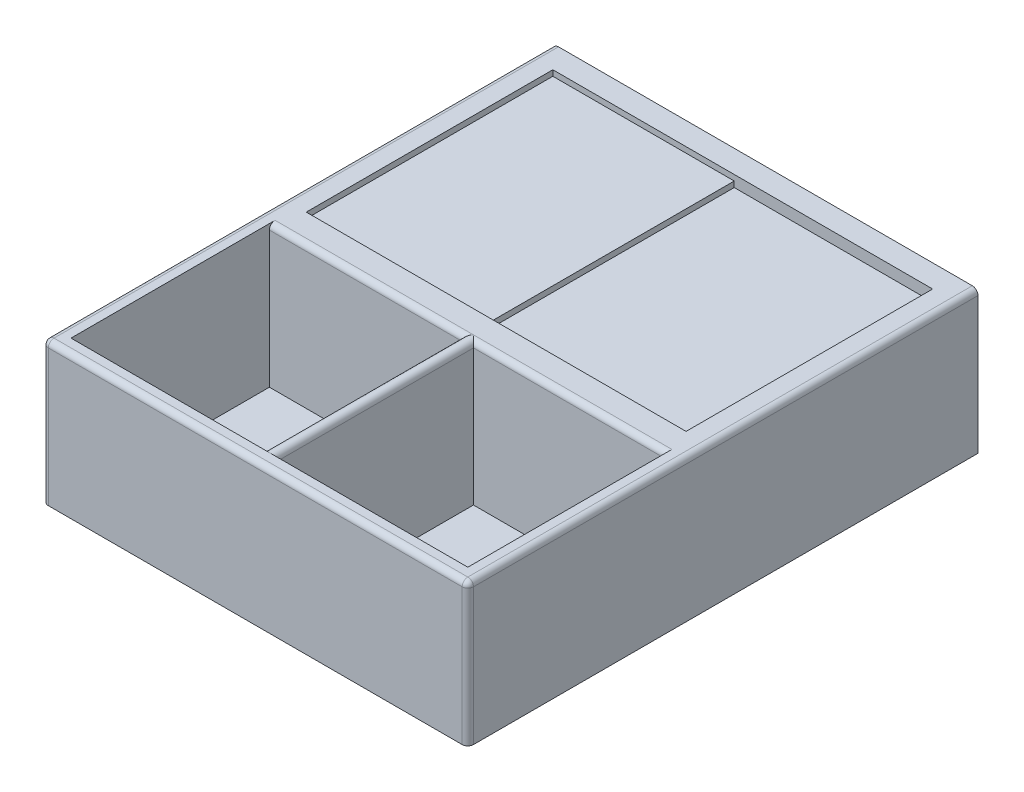
ISO-10303-21;
HEADER;
FILE_DESCRIPTION(('STEP AP214'),'2;1');
FILE_NAME('part.step','',(''),(''),'','','');
FILE_SCHEMA(('AUTOMOTIVE_DESIGN { 1 0 10303 214 1 1 1 1 }'));
ENDSEC;
DATA;
#1=APPLICATION_CONTEXT('core data for automotive mechanical design processes');
#2=APPLICATION_PROTOCOL_DEFINITION('international standard','automotive_design',2000,#1);
#3=PRODUCT_CONTEXT('',#1,'mechanical');
#4=PRODUCT('Part','Part','',(#3));
#5=PRODUCT_RELATED_PRODUCT_CATEGORY('part','',(#4));
#6=PRODUCT_DEFINITION_FORMATION('','',#4);
#7=PRODUCT_DEFINITION_CONTEXT('part definition',#1,'design');
#8=PRODUCT_DEFINITION('design','',#6,#7);
#9=PRODUCT_DEFINITION_SHAPE('','',#8);
#10=(LENGTH_UNIT() NAMED_UNIT(*) SI_UNIT(.MILLI.,.METRE.));
#11=(NAMED_UNIT(*) PLANE_ANGLE_UNIT() SI_UNIT($,.RADIAN.));
#12=(NAMED_UNIT(*) SI_UNIT($,.STERADIAN.) SOLID_ANGLE_UNIT());
#13=UNCERTAINTY_MEASURE_WITH_UNIT(LENGTH_MEASURE(1.E-05),#10,'distance_accuracy_value','');
#14=(GEOMETRIC_REPRESENTATION_CONTEXT(3) GLOBAL_UNCERTAINTY_ASSIGNED_CONTEXT((#13)) GLOBAL_UNIT_ASSIGNED_CONTEXT((#10,
#11,#12)) REPRESENTATION_CONTEXT('',''));
#15=CARTESIAN_POINT('',(0.,0.,0.));
#16=DIRECTION('',(0.,0.,1.));
#17=DIRECTION('',(1.,0.,0.));
#18=AXIS2_PLACEMENT_3D('',#15,#16,#17);
#19=CARTESIAN_POINT('',(-29.9999999999998,-1040.,1050.));
#20=DIRECTION('',(1.,0.,0.));
#21=DIRECTION('',(0.,0.,-1.));
#22=AXIS2_PLACEMENT_3D('',#19,#20,#21);
#23=PLANE('',#22);
#24=DIRECTION('',(0.,0.,-1.));
#25=VECTOR('',#24,1.);
#26=CARTESIAN_POINT('',(-29.9999999999998,-1020.,615.));
#27=LINE('',#26,#25);
#28=CARTESIAN_POINT('',(-29.9999999999998,-1020.,1050.));
#29=VERTEX_POINT('',#28);
#30=CARTESIAN_POINT('',(-29.9999999999998,-1020.,180.));
#31=VERTEX_POINT('',#30);
#32=EDGE_CURVE('E10',#29,#31,#27,.T.);
#33=ORIENTED_EDGE('',*,*,#32,.F.);
#34=DIRECTION('',(0.,1.,0.));
#35=VECTOR('',#34,1.);
#36=CARTESIAN_POINT('',(-29.9999999999998,-1030.,1050.));
#37=LINE('',#36,#35);
#38=CARTESIAN_POINT('',(-29.9999999999998,-1040.,1050.));
#39=VERTEX_POINT('',#38);
#40=EDGE_CURVE('E27',#39,#29,#37,.T.);
#41=ORIENTED_EDGE('',*,*,#40,.F.);
#42=DIRECTION('',(0.,0.,-1.));
#43=VECTOR('',#42,1.);
#44=CARTESIAN_POINT('',(-29.9999999999998,-1040.,615.));
#45=LINE('',#44,#43);
#46=CARTESIAN_POINT('',(-29.9999999999998,-1040.,180.));
#47=VERTEX_POINT('',#46);
#48=EDGE_CURVE('E390',#39,#47,#45,.T.);
#49=ORIENTED_EDGE('',*,*,#48,.T.);
#50=DIRECTION('',(0.,1.,0.));
#51=VECTOR('',#50,1.);
#52=CARTESIAN_POINT('',(-29.9999999999998,-1030.,180.));
#53=LINE('',#52,#51);
#54=EDGE_CURVE('E36',#47,#31,#53,.T.);
#55=ORIENTED_EDGE('',*,*,#54,.T.);
#56=EDGE_LOOP('',(#33,#41,#49,#55));
#57=FACE_BOUND('',#56,.T.);
#58=ADVANCED_FACE('F16',(#57),#23,.T.);
#59=CARTESIAN_POINT('',(0.,-1020.,0.));
#60=DIRECTION('',(0.,1.,0.));
#61=DIRECTION('',(0.,0.,1.));
#62=AXIS2_PLACEMENT_3D('',#59,#60,#61);
#63=PLANE('',#62);
#64=DIRECTION('',(1.,0.,0.));
#65=VECTOR('',#64,1.);
#66=CARTESIAN_POINT('',(-350.,-1020.,1050.));
#67=LINE('',#66,#65);
#68=CARTESIAN_POINT('',(-670.,-1020.,1050.));
#69=VERTEX_POINT('',#68);
#70=EDGE_CURVE('E453',#69,#29,#67,.T.);
#71=ORIENTED_EDGE('',*,*,#70,.T.);
#72=ORIENTED_EDGE('',*,*,#32,.T.);
#73=DIRECTION('',(-1.,0.,0.));
#74=VECTOR('',#73,1.);
#75=CARTESIAN_POINT('',(-350.,-1020.,180.));
#76=LINE('',#75,#74);
#77=CARTESIAN_POINT('',(-670.,-1020.,180.));
#78=VERTEX_POINT('',#77);
#79=EDGE_CURVE('E431',#31,#78,#76,.T.);
#80=ORIENTED_EDGE('',*,*,#79,.T.);
#81=DIRECTION('',(0.,0.,1.));
#82=VECTOR('',#81,1.);
#83=CARTESIAN_POINT('',(-670.,-1020.,615.));
#84=LINE('',#83,#82);
#85=EDGE_CURVE('E447',#78,#69,#84,.T.);
#86=ORIENTED_EDGE('',*,*,#85,.T.);
#87=EDGE_LOOP('',(#71,#72,#80,#86));
#88=FACE_BOUND('',#87,.T.);
#89=ADVANCED_FACE('F490',(#88),#63,.T.);
#90=CARTESIAN_POINT('',(-670.,-1000.,180.));
#91=DIRECTION('',(1.,0.,0.));
#92=DIRECTION('',(0.,0.,-1.));
#93=AXIS2_PLACEMENT_3D('',#90,#91,#92);
#94=PLANE('',#93);
#95=ORIENTED_EDGE('',*,*,#85,.F.);
#96=DIRECTION('',(0.,-1.,0.));
#97=VECTOR('',#96,1.);
#98=CARTESIAN_POINT('',(-670.,-1010.,180.));
#99=LINE('',#98,#97);
#100=CARTESIAN_POINT('',(-670.,-1000.,180.));
#101=VERTEX_POINT('',#100);
#102=EDGE_CURVE('E440',#101,#78,#99,.T.);
#103=ORIENTED_EDGE('',*,*,#102,.F.);
#104=DIRECTION('',(0.,0.,1.));
#105=VECTOR('',#104,1.);
#106=CARTESIAN_POINT('',(-670.,-1000.,615.000000000001));
#107=LINE('',#106,#105);
#108=CARTESIAN_POINT('',(-670.,-1000.,1050.));
#109=VERTEX_POINT('',#108);
#110=EDGE_CURVE('E208',#101,#109,#107,.T.);
#111=ORIENTED_EDGE('',*,*,#110,.T.);
#112=DIRECTION('',(0.,-1.,0.));
#113=VECTOR('',#112,1.);
#114=CARTESIAN_POINT('',(-670.,-1010.,1050.));
#115=LINE('',#114,#113);
#116=EDGE_CURVE('E420',#109,#69,#115,.T.);
#117=ORIENTED_EDGE('',*,*,#116,.T.);
#118=EDGE_LOOP('',(#95,#103,#111,#117));
#119=FACE_BOUND('',#118,.T.);
#120=ADVANCED_FACE('F488',(#119),#94,.T.);
#121=CARTESIAN_POINT('',(-670.,-1000.,180.));
#122=DIRECTION('',(0.,0.,-1.));
#123=DIRECTION('',(-1.,0.,0.));
#124=AXIS2_PLACEMENT_3D('',#121,#122,#123);
#125=PLANE('',#124);
#126=ORIENTED_EDGE('',*,*,#102,.T.);
#127=ORIENTED_EDGE('',*,*,#79,.F.);
#128=ORIENTED_EDGE('',*,*,#54,.F.);
#129=DIRECTION('',(-1.,0.,0.));
#130=VECTOR('',#129,1.);
#131=CARTESIAN_POINT('',(320.,-1040.,180.));
#132=LINE('',#131,#130);
#133=CARTESIAN_POINT('',(670.,-1040.,180.));
#134=VERTEX_POINT('',#133);
#135=EDGE_CURVE('E432',#134,#47,#132,.T.);
#136=ORIENTED_EDGE('',*,*,#135,.F.);
#137=DIRECTION('',(0.,-1.,0.));
#138=VECTOR('',#137,1.);
#139=CARTESIAN_POINT('',(670.,-1020.,180.));
#140=LINE('',#139,#138);
#141=CARTESIAN_POINT('',(670.,-1000.,180.));
#142=VERTEX_POINT('',#141);
#143=EDGE_CURVE('E436',#142,#134,#140,.T.);
#144=ORIENTED_EDGE('',*,*,#143,.F.);
#145=DIRECTION('',(-1.,0.,0.));
#146=VECTOR('',#145,1.);
#147=CARTESIAN_POINT('',(2.27373675443232E-13,-1000.,180.));
#148=LINE('',#147,#146);
#149=EDGE_CURVE('E427',#142,#101,#148,.T.);
#150=ORIENTED_EDGE('',*,*,#149,.T.);
#151=EDGE_LOOP('',(#126,#127,#128,#136,#144,#150));
#152=FACE_BOUND('',#151,.T.);
#153=ADVANCED_FACE('F475',(#152),#125,.F.);
#154=CARTESIAN_POINT('',(670.,-1000.,1050.));
#155=DIRECTION('',(-1.,0.,0.));
#156=DIRECTION('',(0.,0.,1.));
#157=AXIS2_PLACEMENT_3D('',#154,#155,#156);
#158=PLANE('',#157);
#159=DIRECTION('',(0.,0.,-1.));
#160=VECTOR('',#159,1.);
#161=CARTESIAN_POINT('',(670.,-1040.,615.));
#162=LINE('',#161,#160);
#163=CARTESIAN_POINT('',(670.,-1040.,1050.));
#164=VERTEX_POINT('',#163);
#165=EDGE_CURVE('E423',#164,#134,#162,.T.);
#166=ORIENTED_EDGE('',*,*,#165,.F.);
#167=DIRECTION('',(0.,-1.,0.));
#168=VECTOR('',#167,1.);
#169=CARTESIAN_POINT('',(670.,-1020.,1050.));
#170=LINE('',#169,#168);
#171=CARTESIAN_POINT('',(670.,-1000.,1050.));
#172=VERTEX_POINT('',#171);
#173=EDGE_CURVE('E419',#172,#164,#170,.T.);
#174=ORIENTED_EDGE('',*,*,#173,.F.);
#175=DIRECTION('',(0.,0.,-1.));
#176=VECTOR('',#175,1.);
#177=CARTESIAN_POINT('',(670.,-1000.,615.));
#178=LINE('',#177,#176);
#179=EDGE_CURVE('E414',#172,#142,#178,.T.);
#180=ORIENTED_EDGE('',*,*,#179,.T.);
#181=ORIENTED_EDGE('',*,*,#143,.T.);
#182=EDGE_LOOP('',(#166,#174,#180,#181));
#183=FACE_BOUND('',#182,.T.);
#184=ADVANCED_FACE('F481',(#183),#158,.T.);
#185=CARTESIAN_POINT('',(670.,-1000.,1050.));
#186=DIRECTION('',(0.,0.,1.));
#187=DIRECTION('',(1.,0.,0.));
#188=AXIS2_PLACEMENT_3D('',#185,#186,#187);
#189=PLANE('',#188);
#190=DIRECTION('',(1.,0.,0.));
#191=VECTOR('',#190,1.);
#192=CARTESIAN_POINT('',(320.,-1040.,1050.));
#193=LINE('',#192,#191);
#194=EDGE_CURVE('E415',#39,#164,#193,.T.);
#195=ORIENTED_EDGE('',*,*,#194,.F.);
#196=ORIENTED_EDGE('',*,*,#40,.T.);
#197=ORIENTED_EDGE('',*,*,#70,.F.);
#198=ORIENTED_EDGE('',*,*,#116,.F.);
#199=DIRECTION('',(1.,0.,0.));
#200=VECTOR('',#199,1.);
#201=CARTESIAN_POINT('',(3.41060513164848E-13,-1000.,1050.));
#202=LINE('',#201,#200);
#203=EDGE_CURVE('E359',#109,#172,#202,.T.);
#204=ORIENTED_EDGE('',*,*,#203,.T.);
#205=ORIENTED_EDGE('',*,*,#173,.T.);
#206=EDGE_LOOP('',(#195,#196,#197,#198,#204,#205));
#207=FACE_BOUND('',#206,.T.);
#208=ADVANCED_FACE('F492',(#207),#189,.F.);
#209=CARTESIAN_POINT('',(0.,-1040.,0.));
#210=DIRECTION('',(0.,1.,0.));
#211=DIRECTION('',(0.,0.,1.));
#212=AXIS2_PLACEMENT_3D('',#209,#210,#211);
#213=PLANE('',#212);
#214=ORIENTED_EDGE('',*,*,#48,.F.);
#215=ORIENTED_EDGE('',*,*,#194,.T.);
#216=ORIENTED_EDGE('',*,*,#165,.T.);
#217=ORIENTED_EDGE('',*,*,#135,.T.);
#218=EDGE_LOOP('',(#214,#215,#216,#217));
#219=FACE_BOUND('',#218,.T.);
#220=ADVANCED_FACE('F477',(#219),#213,.T.);
#221=CARTESIAN_POINT('',(0.,-1500.,0.));
#222=DIRECTION('',(0.,1.,0.));
#223=DIRECTION('',(0.,0.,1.));
#224=AXIS2_PLACEMENT_3D('',#221,#222,#223);
#225=PLANE('',#224);
#226=DIRECTION('',(1.,0.,0.));
#227=VECTOR('',#226,1.);
#228=CARTESIAN_POINT('',(360.,-1500.,1850.));
#229=LINE('',#228,#227);
#230=CARTESIAN_POINT('',(20.0000000000001,-1500.,1850.));
#231=VERTEX_POINT('',#230);
#232=CARTESIAN_POINT('',(700.,-1500.,1850.));
#233=VERTEX_POINT('',#232);
#234=EDGE_CURVE('E268',#231,#233,#229,.T.);
#235=ORIENTED_EDGE('',*,*,#234,.T.);
#236=DIRECTION('',(0.,0.,-1.));
#237=VECTOR('',#236,1.);
#238=CARTESIAN_POINT('',(700.,-1500.,1500.));
#239=LINE('',#238,#237);
#240=CARTESIAN_POINT('',(700.,-1500.,1150.));
#241=VERTEX_POINT('',#240);
#242=EDGE_CURVE('E279',#233,#241,#239,.T.);
#243=ORIENTED_EDGE('',*,*,#242,.T.);
#244=DIRECTION('',(-1.,0.,0.));
#245=VECTOR('',#244,1.);
#246=CARTESIAN_POINT('',(360.,-1500.,1150.));
#247=LINE('',#246,#245);
#248=CARTESIAN_POINT('',(20.,-1500.,1150.));
#249=VERTEX_POINT('',#248);
#250=EDGE_CURVE('E231',#241,#249,#247,.T.);
#251=ORIENTED_EDGE('',*,*,#250,.T.);
#252=DIRECTION('',(0.,0.,1.));
#253=VECTOR('',#252,1.);
#254=CARTESIAN_POINT('',(20.0000000000001,-1500.,1500.));
#255=LINE('',#254,#253);
#256=EDGE_CURVE('E227',#249,#231,#255,.T.);
#257=ORIENTED_EDGE('',*,*,#256,.T.);
#258=EDGE_LOOP('',(#235,#243,#251,#257));
#259=FACE_BOUND('',#258,.T.);
#260=ADVANCED_FACE('F500',(#259),#225,.T.);
#261=CARTESIAN_POINT('',(0.,-1500.,0.));
#262=DIRECTION('',(0.,1.,0.));
#263=DIRECTION('',(0.,0.,1.));
#264=AXIS2_PLACEMENT_3D('',#261,#262,#263);
#265=PLANE('',#264);
#266=DIRECTION('',(0.,0.,1.));
#267=VECTOR('',#266,1.);
#268=CARTESIAN_POINT('',(-700.,-1500.,1500.));
#269=LINE('',#268,#267);
#270=CARTESIAN_POINT('',(-700.,-1500.,1150.));
#271=VERTEX_POINT('',#270);
#272=CARTESIAN_POINT('',(-700.,-1500.,1850.));
#273=VERTEX_POINT('',#272);
#274=EDGE_CURVE('E240',#271,#273,#269,.T.);
#275=ORIENTED_EDGE('',*,*,#274,.T.);
#276=DIRECTION('',(1.,0.,0.));
#277=VECTOR('',#276,1.);
#278=CARTESIAN_POINT('',(-360.,-1500.,1850.));
#279=LINE('',#278,#277);
#280=CARTESIAN_POINT('',(-19.9999999999998,-1500.,1850.));
#281=VERTEX_POINT('',#280);
#282=EDGE_CURVE('E255',#273,#281,#279,.T.);
#283=ORIENTED_EDGE('',*,*,#282,.T.);
#284=DIRECTION('',(0.,0.,-1.));
#285=VECTOR('',#284,1.);
#286=CARTESIAN_POINT('',(-19.9999999999995,-1500.,1500.));
#287=LINE('',#286,#285);
#288=CARTESIAN_POINT('',(-19.9999999999995,-1500.,1150.));
#289=VERTEX_POINT('',#288);
#290=EDGE_CURVE('E263',#281,#289,#287,.T.);
#291=ORIENTED_EDGE('',*,*,#290,.T.);
#292=DIRECTION('',(-1.,0.,0.));
#293=VECTOR('',#292,1.);
#294=CARTESIAN_POINT('',(-360.,-1500.,1150.));
#295=LINE('',#294,#293);
#296=EDGE_CURVE('E241',#289,#271,#295,.T.);
#297=ORIENTED_EDGE('',*,*,#296,.T.);
#298=EDGE_LOOP('',(#275,#283,#291,#297));
#299=FACE_BOUND('',#298,.T.);
#300=ADVANCED_FACE('F544',(#299),#265,.T.);
#301=CARTESIAN_POINT('',(750.,0.,1900.));
#302=DIRECTION('',(-1.,0.,0.));
#303=DIRECTION('',(0.,0.,1.));
#304=AXIS2_PLACEMENT_3D('',#301,#302,#303);
#305=PLANE('',#304);
#306=DIRECTION('',(0.,-1.,0.));
#307=VECTOR('',#306,1.);
#308=CARTESIAN_POINT('',(750.,-1261.,100.));
#309=LINE('',#308,#307);
#310=CARTESIAN_POINT('',(750.,-1020.,100.));
#311=VERTEX_POINT('',#310);
#312=CARTESIAN_POINT('',(750.,-1502.,100.));
#313=VERTEX_POINT('',#312);
#314=EDGE_CURVE('E378',#311,#313,#309,.T.);
#315=ORIENTED_EDGE('',*,*,#314,.F.);
#316=DIRECTION('',(0.,0.,1.));
#317=VECTOR('',#316,1.);
#318=CARTESIAN_POINT('',(750.,-1020.,990.));
#319=LINE('',#318,#317);
#320=CARTESIAN_POINT('',(750.,-1020.,1880.));
#321=VERTEX_POINT('',#320);
#322=EDGE_CURVE('E371',#311,#321,#319,.T.);
#323=ORIENTED_EDGE('',*,*,#322,.T.);
#324=DIRECTION('',(0.,-1.,0.));
#325=VECTOR('',#324,1.);
#326=CARTESIAN_POINT('',(750.,-1261.,1880.));
#327=LINE('',#326,#325);
#328=CARTESIAN_POINT('',(750.,-1502.,1880.));
#329=VERTEX_POINT('',#328);
#330=EDGE_CURVE('E379',#321,#329,#327,.T.);
#331=ORIENTED_EDGE('',*,*,#330,.T.);
#332=DIRECTION('',(0.,0.,-1.));
#333=VECTOR('',#332,1.);
#334=CARTESIAN_POINT('',(750.,-1502.,990.));
#335=LINE('',#334,#333);
#336=EDGE_CURVE('E336',#329,#313,#335,.T.);
#337=ORIENTED_EDGE('',*,*,#336,.T.);
#338=EDGE_LOOP('',(#315,#323,#331,#337));
#339=FACE_BOUND('',#338,.T.);
#340=ADVANCED_FACE('F553',(#339),#305,.F.);
#341=CARTESIAN_POINT('',(730.,-1020.,1880.));
#342=DIRECTION('',(0.,0.,1.));
#343=DIRECTION('',(1.,0.,0.));
#344=AXIS2_PLACEMENT_3D('',#341,#342,#343);
#345=SPHERICAL_SURFACE('',#344,19.9999999999999);
#346=CARTESIAN_POINT('',(730.,-1020.,1880.));
#347=DIRECTION('',(0.,-1.,0.));
#348=DIRECTION('',(0.,0.,1.));
#349=AXIS2_PLACEMENT_3D('',#346,#347,#348);
#350=CIRCLE('',#349,19.9999999999999);
#351=CARTESIAN_POINT('',(730.,-1020.,1900.));
#352=VERTEX_POINT('',#351);
#353=EDGE_CURVE('E374',#321,#352,#350,.T.);
#354=ORIENTED_EDGE('',*,*,#353,.F.);
#355=CARTESIAN_POINT('',(730.,-1020.,1880.));
#356=DIRECTION('',(0.,0.,1.));
#357=DIRECTION('',(0.,1.,0.));
#358=AXIS2_PLACEMENT_3D('',#355,#356,#357);
#359=CIRCLE('',#358,19.9999999999999);
#360=CARTESIAN_POINT('',(730.,-1000.,1880.));
#361=VERTEX_POINT('',#360);
#362=EDGE_CURVE('E350',#321,#361,#359,.T.);
#363=ORIENTED_EDGE('',*,*,#362,.T.);
#364=CARTESIAN_POINT('',(730.,-1020.,1880.));
#365=DIRECTION('',(1.,0.,0.));
#366=DIRECTION('',(0.,0.,-1.));
#367=AXIS2_PLACEMENT_3D('',#364,#365,#366);
#368=CIRCLE('',#367,19.9999999999999);
#369=EDGE_CURVE('E308',#361,#352,#368,.T.);
#370=ORIENTED_EDGE('',*,*,#369,.T.);
#371=EDGE_LOOP('',(#354,#363,#370));
#372=FACE_BOUND('',#371,.T.);
#373=ADVANCED_FACE('F562',(#372),#345,.T.);
#374=CARTESIAN_POINT('',(730.,-1251.,1880.));
#375=DIRECTION('',(0.,-1.,0.));
#376=DIRECTION('',(0.,0.,-1.));
#377=AXIS2_PLACEMENT_3D('',#374,#375,#376);
#378=CYLINDRICAL_SURFACE('',#377,20.);
#379=CARTESIAN_POINT('',(730.,-1502.,1880.));
#380=DIRECTION('',(0.,1.,0.));
#381=DIRECTION('',(0.,0.,-1.));
#382=AXIS2_PLACEMENT_3D('',#379,#380,#381);
#383=CIRCLE('',#382,20.);
#384=CARTESIAN_POINT('',(730.,-1502.,1900.));
#385=VERTEX_POINT('',#384);
#386=EDGE_CURVE('E328',#385,#329,#383,.T.);
#387=ORIENTED_EDGE('',*,*,#386,.T.);
#388=ORIENTED_EDGE('',*,*,#330,.F.);
#389=ORIENTED_EDGE('',*,*,#353,.T.);
#390=DIRECTION('',(0.,-1.,0.));
#391=VECTOR('',#390,1.);
#392=CARTESIAN_POINT('',(730.,-1251.,1900.));
#393=LINE('',#392,#391);
#394=EDGE_CURVE('E307',#352,#385,#393,.T.);
#395=ORIENTED_EDGE('',*,*,#394,.T.);
#396=EDGE_LOOP('',(#387,#388,#389,#395));
#397=FACE_BOUND('',#396,.T.);
#398=ADVANCED_FACE('F571',(#397),#378,.T.);
#399=CARTESIAN_POINT('',(730.,-1020.,1000.));
#400=DIRECTION('',(0.,0.,1.));
#401=DIRECTION('',(1.,0.,0.));
#402=AXIS2_PLACEMENT_3D('',#399,#400,#401);
#403=CYLINDRICAL_SURFACE('',#402,20.);
#404=CARTESIAN_POINT('',(730.,-1020.,100.));
#405=DIRECTION('',(0.,0.,1.));
#406=DIRECTION('',(1.,0.,0.));
#407=AXIS2_PLACEMENT_3D('',#404,#405,#406);
#408=CIRCLE('',#407,20.);
#409=CARTESIAN_POINT('',(730.,-1000.,100.));
#410=VERTEX_POINT('',#409);
#411=EDGE_CURVE('E331',#311,#410,#408,.T.);
#412=ORIENTED_EDGE('',*,*,#411,.T.);
#413=DIRECTION('',(0.,0.,1.));
#414=VECTOR('',#413,1.);
#415=CARTESIAN_POINT('',(730.,-1000.,1000.));
#416=LINE('',#415,#414);
#417=EDGE_CURVE('E356',#410,#361,#416,.T.);
#418=ORIENTED_EDGE('',*,*,#417,.T.);
#419=ORIENTED_EDGE('',*,*,#362,.F.);
#420=ORIENTED_EDGE('',*,*,#322,.F.);
#421=EDGE_LOOP('',(#412,#418,#419,#420));
#422=FACE_BOUND('',#421,.T.);
#423=ADVANCED_FACE('F580',(#422),#403,.T.);
#424=CARTESIAN_POINT('',(-750.,0.,100.));
#425=DIRECTION('',(1.,0.,0.));
#426=DIRECTION('',(0.,0.,-1.));
#427=AXIS2_PLACEMENT_3D('',#424,#425,#426);
#428=PLANE('',#427);
#429=DIRECTION('',(0.,0.,1.));
#430=VECTOR('',#429,1.);
#431=CARTESIAN_POINT('',(-750.,-1502.,990.));
#432=LINE('',#431,#430);
#433=CARTESIAN_POINT('',(-750.,-1502.,100.));
#434=VERTEX_POINT('',#433);
#435=CARTESIAN_POINT('',(-750.,-1502.,1880.));
#436=VERTEX_POINT('',#435);
#437=EDGE_CURVE('E322',#434,#436,#432,.T.);
#438=ORIENTED_EDGE('',*,*,#437,.T.);
#439=DIRECTION('',(0.,-1.,0.));
#440=VECTOR('',#439,1.);
#441=CARTESIAN_POINT('',(-750.,-1261.,1880.));
#442=LINE('',#441,#440);
#443=CARTESIAN_POINT('',(-750.,-1020.,1880.));
#444=VERTEX_POINT('',#443);
#445=EDGE_CURVE('E341',#444,#436,#442,.T.);
#446=ORIENTED_EDGE('',*,*,#445,.F.);
#447=DIRECTION('',(0.,0.,1.));
#448=VECTOR('',#447,1.);
#449=CARTESIAN_POINT('',(-750.,-1020.,990.));
#450=LINE('',#449,#448);
#451=CARTESIAN_POINT('',(-750.,-1020.,100.));
#452=VERTEX_POINT('',#451);
#453=EDGE_CURVE('E346',#452,#444,#450,.T.);
#454=ORIENTED_EDGE('',*,*,#453,.F.);
#455=DIRECTION('',(0.,-1.,0.));
#456=VECTOR('',#455,1.);
#457=CARTESIAN_POINT('',(-750.,-1261.,100.));
#458=LINE('',#457,#456);
#459=EDGE_CURVE('E342',#452,#434,#458,.T.);
#460=ORIENTED_EDGE('',*,*,#459,.T.);
#461=EDGE_LOOP('',(#438,#446,#454,#460));
#462=FACE_BOUND('',#461,.T.);
#463=ADVANCED_FACE('F589',(#462),#428,.F.);
#464=CARTESIAN_POINT('',(-750.,0.,100.));
#465=DIRECTION('',(0.,0.,-1.));
#466=DIRECTION('',(-1.,0.,0.));
#467=AXIS2_PLACEMENT_3D('',#464,#465,#466);
#468=PLANE('',#467);
#469=CARTESIAN_POINT('',(-730.,-1020.,100.));
#470=DIRECTION('',(0.,0.,1.));
#471=DIRECTION('',(-1.,0.,0.));
#472=AXIS2_PLACEMENT_3D('',#469,#470,#471);
#473=CIRCLE('',#472,20.);
#474=CARTESIAN_POINT('',(-730.,-1000.,100.));
#475=VERTEX_POINT('',#474);
#476=EDGE_CURVE('E337',#475,#452,#473,.T.);
#477=ORIENTED_EDGE('',*,*,#476,.F.);
#478=DIRECTION('',(-1.,0.,0.));
#479=VECTOR('',#478,1.);
#480=CARTESIAN_POINT('',(1.13686837721616E-13,-1000.,100.));
#481=LINE('',#480,#479);
#482=EDGE_CURVE('E327',#410,#475,#481,.T.);
#483=ORIENTED_EDGE('',*,*,#482,.F.);
#484=ORIENTED_EDGE('',*,*,#411,.F.);
#485=ORIENTED_EDGE('',*,*,#314,.T.);
#486=DIRECTION('',(-1.,0.,0.));
#487=VECTOR('',#486,1.);
#488=CARTESIAN_POINT('',(1.13686837721616E-13,-1502.,100.));
#489=LINE('',#488,#487);
#490=EDGE_CURVE('E332',#313,#434,#489,.T.);
#491=ORIENTED_EDGE('',*,*,#490,.T.);
#492=ORIENTED_EDGE('',*,*,#459,.F.);
#493=EDGE_LOOP('',(#477,#483,#484,#485,#491,#492));
#494=FACE_BOUND('',#493,.T.);
#495=ADVANCED_FACE('F598',(#494),#468,.T.);
#496=CARTESIAN_POINT('',(0.,-1502.,0.));
#497=DIRECTION('',(0.,1.,0.));
#498=DIRECTION('',(0.,0.,1.));
#499=AXIS2_PLACEMENT_3D('',#496,#497,#498);
#500=PLANE('',#499);
#501=DIRECTION('',(1.,0.,0.));
#502=VECTOR('',#501,1.);
#503=CARTESIAN_POINT('',(1.13686837721616E-13,-1502.,1900.));
#504=LINE('',#503,#502);
#505=CARTESIAN_POINT('',(-730.,-1502.,1900.));
#506=VERTEX_POINT('',#505);
#507=EDGE_CURVE('E323',#506,#385,#504,.T.);
#508=ORIENTED_EDGE('',*,*,#507,.F.);
#509=CARTESIAN_POINT('',(-730.,-1502.,1880.));
#510=DIRECTION('',(0.,1.,0.));
#511=DIRECTION('',(0.,0.,1.));
#512=AXIS2_PLACEMENT_3D('',#509,#510,#511);
#513=CIRCLE('',#512,20.);
#514=EDGE_CURVE('E316',#436,#506,#513,.T.);
#515=ORIENTED_EDGE('',*,*,#514,.F.);
#516=ORIENTED_EDGE('',*,*,#437,.F.);
#517=ORIENTED_EDGE('',*,*,#490,.F.);
#518=ORIENTED_EDGE('',*,*,#336,.F.);
#519=ORIENTED_EDGE('',*,*,#386,.F.);
#520=EDGE_LOOP('',(#508,#515,#516,#517,#518,#519));
#521=FACE_BOUND('',#520,.T.);
#522=ADVANCED_FACE('F607',(#521),#500,.F.);
#523=CARTESIAN_POINT('',(750.,0.,1900.));
#524=DIRECTION('',(0.,0.,1.));
#525=DIRECTION('',(1.,0.,0.));
#526=AXIS2_PLACEMENT_3D('',#523,#524,#525);
#527=PLANE('',#526);
#528=DIRECTION('',(0.,-1.,0.));
#529=VECTOR('',#528,1.);
#530=CARTESIAN_POINT('',(-730.,-1261.,1900.));
#531=LINE('',#530,#529);
#532=CARTESIAN_POINT('',(-730.,-1020.,1900.));
#533=VERTEX_POINT('',#532);
#534=EDGE_CURVE('E295',#533,#506,#531,.T.);
#535=ORIENTED_EDGE('',*,*,#534,.T.);
#536=ORIENTED_EDGE('',*,*,#507,.T.);
#537=ORIENTED_EDGE('',*,*,#394,.F.);
#538=DIRECTION('',(1.,0.,0.));
#539=VECTOR('',#538,1.);
#540=CARTESIAN_POINT('',(1.13686837721616E-13,-1020.,1900.));
#541=LINE('',#540,#539);
#542=EDGE_CURVE('E312',#533,#352,#541,.T.);
#543=ORIENTED_EDGE('',*,*,#542,.F.);
#544=EDGE_LOOP('',(#535,#536,#537,#543));
#545=FACE_BOUND('',#544,.T.);
#546=ADVANCED_FACE('F616',(#545),#527,.T.);
#547=CARTESIAN_POINT('',(-2.27373675443232E-13,-1020.,1880.));
#548=DIRECTION('',(-1.,0.,0.));
#549=DIRECTION('',(0.,0.,1.));
#550=AXIS2_PLACEMENT_3D('',#547,#548,#549);
#551=CYLINDRICAL_SURFACE('',#550,20.);
#552=CARTESIAN_POINT('',(-730.,-1020.,1880.));
#553=DIRECTION('',(1.,0.,0.));
#554=DIRECTION('',(0.,0.,1.));
#555=AXIS2_PLACEMENT_3D('',#552,#553,#554);
#556=CIRCLE('',#555,20.);
#557=CARTESIAN_POINT('',(-730.,-1000.,1880.));
#558=VERTEX_POINT('',#557);
#559=EDGE_CURVE('E302',#558,#533,#556,.T.);
#560=ORIENTED_EDGE('',*,*,#559,.T.);
#561=ORIENTED_EDGE('',*,*,#542,.T.);
#562=ORIENTED_EDGE('',*,*,#369,.F.);
#563=DIRECTION('',(1.,0.,0.));
#564=VECTOR('',#563,1.);
#565=CARTESIAN_POINT('',(-2.27373675443232E-13,-1000.,1880.));
#566=LINE('',#565,#564);
#567=EDGE_CURVE('E303',#558,#361,#566,.T.);
#568=ORIENTED_EDGE('',*,*,#567,.F.);
#569=EDGE_LOOP('',(#560,#561,#562,#568));
#570=FACE_BOUND('',#569,.T.);
#571=ADVANCED_FACE('F625',(#570),#551,.T.);
#572=CARTESIAN_POINT('',(-730.,-1020.,1880.));
#573=DIRECTION('',(0.,0.,1.));
#574=DIRECTION('',(1.,0.,0.));
#575=AXIS2_PLACEMENT_3D('',#572,#573,#574);
#576=SPHERICAL_SURFACE('',#575,19.9999999999997);
#577=ORIENTED_EDGE('',*,*,#559,.F.);
#578=CARTESIAN_POINT('',(-730.,-1020.,1880.));
#579=DIRECTION('',(0.,0.,1.));
#580=DIRECTION('',(0.,-1.,0.));
#581=AXIS2_PLACEMENT_3D('',#578,#579,#580);
#582=CIRCLE('',#581,19.9999999999997);
#583=EDGE_CURVE('E226',#558,#444,#582,.T.);
#584=ORIENTED_EDGE('',*,*,#583,.T.);
#585=CARTESIAN_POINT('',(-730.,-1020.,1880.));
#586=DIRECTION('',(0.,-1.,0.));
#587=DIRECTION('',(0.,0.,-1.));
#588=AXIS2_PLACEMENT_3D('',#585,#586,#587);
#589=CIRCLE('',#588,19.9999999999997);
#590=EDGE_CURVE('E299',#533,#444,#589,.T.);
#591=ORIENTED_EDGE('',*,*,#590,.F.);
#592=EDGE_LOOP('',(#577,#584,#591));
#593=FACE_BOUND('',#592,.T.);
#594=ADVANCED_FACE('F634',(#593),#576,.T.);
#595=CARTESIAN_POINT('',(-730.,-1251.,1880.));
#596=DIRECTION('',(0.,-1.,0.));
#597=DIRECTION('',(0.,0.,-1.));
#598=AXIS2_PLACEMENT_3D('',#595,#596,#597);
#599=CYLINDRICAL_SURFACE('',#598,20.);
#600=ORIENTED_EDGE('',*,*,#514,.T.);
#601=ORIENTED_EDGE('',*,*,#534,.F.);
#602=ORIENTED_EDGE('',*,*,#590,.T.);
#603=ORIENTED_EDGE('',*,*,#445,.T.);
#604=EDGE_LOOP('',(#600,#601,#602,#603));
#605=FACE_BOUND('',#604,.T.);
#606=ADVANCED_FACE('F643',(#605),#599,.T.);
#607=CARTESIAN_POINT('',(-730.,-1020.,988.));
#608=DIRECTION('',(0.,0.,1.));
#609=DIRECTION('',(1.,0.,0.));
#610=AXIS2_PLACEMENT_3D('',#607,#608,#609);
#611=CYLINDRICAL_SURFACE('',#610,20.);
#612=ORIENTED_EDGE('',*,*,#476,.T.);
#613=ORIENTED_EDGE('',*,*,#453,.T.);
#614=ORIENTED_EDGE('',*,*,#583,.F.);
#615=DIRECTION('',(0.,0.,1.));
#616=VECTOR('',#615,1.);
#617=CARTESIAN_POINT('',(-730.,-1000.,988.));
#618=LINE('',#617,#616);
#619=EDGE_CURVE('E291',#475,#558,#618,.T.);
#620=ORIENTED_EDGE('',*,*,#619,.F.);
#621=EDGE_LOOP('',(#612,#613,#614,#620));
#622=FACE_BOUND('',#621,.T.);
#623=ADVANCED_FACE('F652',(#622),#611,.T.);
#624=CARTESIAN_POINT('',(20.0000000000001,-1000.,1150.));
#625=DIRECTION('',(1.,0.,0.));
#626=DIRECTION('',(0.,0.,-1.));
#627=AXIS2_PLACEMENT_3D('',#624,#625,#626);
#628=PLANE('',#627);
#629=DIRECTION('',(0.,0.,1.));
#630=VECTOR('',#629,1.);
#631=CARTESIAN_POINT('',(20.0000000000001,-1020.,1500.));
#632=LINE('',#631,#630);
#633=CARTESIAN_POINT('',(20.,-1020.,1150.));
#634=VERTEX_POINT('',#633);
#635=CARTESIAN_POINT('',(20.0000000000001,-1020.,1850.));
#636=VERTEX_POINT('',#635);
#637=EDGE_CURVE('E181',#634,#636,#632,.T.);
#638=ORIENTED_EDGE('',*,*,#637,.T.);
#639=DIRECTION('',(0.,-1.,0.));
#640=VECTOR('',#639,1.);
#641=CARTESIAN_POINT('',(20.0000000000001,-1260.,1850.));
#642=LINE('',#641,#640);
#643=EDGE_CURVE('E274',#636,#231,#642,.T.);
#644=ORIENTED_EDGE('',*,*,#643,.T.);
#645=ORIENTED_EDGE('',*,*,#256,.F.);
#646=DIRECTION('',(0.,-1.,0.));
#647=VECTOR('',#646,1.);
#648=CARTESIAN_POINT('',(20.0000000000001,-1260.,1150.));
#649=LINE('',#648,#647);
#650=EDGE_CURVE('E222',#634,#249,#649,.T.);
#651=ORIENTED_EDGE('',*,*,#650,.F.);
#652=EDGE_LOOP('',(#638,#644,#645,#651));
#653=FACE_BOUND('',#652,.T.);
#654=ADVANCED_FACE('F661',(#653),#628,.T.);
#655=CARTESIAN_POINT('',(700.,-1000.,1850.));
#656=DIRECTION('',(-1.,0.,0.));
#657=DIRECTION('',(0.,0.,1.));
#658=AXIS2_PLACEMENT_3D('',#655,#656,#657);
#659=PLANE('',#658);
#660=DIRECTION('',(0.,-1.,0.));
#661=VECTOR('',#660,1.);
#662=CARTESIAN_POINT('',(700.,-1250.,1850.));
#663=LINE('',#662,#661);
#664=CARTESIAN_POINT('',(700.,-1000.,1850.));
#665=VERTEX_POINT('',#664);
#666=EDGE_CURVE('E284',#665,#233,#663,.T.);
#667=ORIENTED_EDGE('',*,*,#666,.F.);
#668=DIRECTION('',(0.,0.,-1.));
#669=VECTOR('',#668,1.);
#670=CARTESIAN_POINT('',(700.,-1000.,1490.));
#671=LINE('',#670,#669);
#672=CARTESIAN_POINT('',(700.,-1000.,1130.));
#673=VERTEX_POINT('',#672);
#674=EDGE_CURVE('E195',#665,#673,#671,.T.);
#675=ORIENTED_EDGE('',*,*,#674,.T.);
#676=CARTESIAN_POINT('',(700.,-1020.,1130.));
#677=DIRECTION('',(-1.,0.,0.));
#678=DIRECTION('',(0.,0.,1.));
#679=AXIS2_PLACEMENT_3D('',#676,#677,#678);
#680=CIRCLE('',#679,20.);
#681=CARTESIAN_POINT('',(700.,-1020.,1150.));
#682=VERTEX_POINT('',#681);
#683=EDGE_CURVE('E192',#682,#673,#680,.T.);
#684=ORIENTED_EDGE('',*,*,#683,.F.);
#685=DIRECTION('',(0.,-1.,0.));
#686=VECTOR('',#685,1.);
#687=CARTESIAN_POINT('',(700.,-1260.,1150.));
#688=LINE('',#687,#686);
#689=EDGE_CURVE('E280',#682,#241,#688,.T.);
#690=ORIENTED_EDGE('',*,*,#689,.T.);
#691=ORIENTED_EDGE('',*,*,#242,.F.);
#692=EDGE_LOOP('',(#667,#675,#684,#690,#691));
#693=FACE_BOUND('',#692,.T.);
#694=ADVANCED_FACE('F670',(#693),#659,.T.);
#695=CARTESIAN_POINT('',(20.,-1000.,1150.));
#696=DIRECTION('',(0.,0.,-1.));
#697=DIRECTION('',(-1.,0.,0.));
#698=AXIS2_PLACEMENT_3D('',#695,#696,#697);
#699=PLANE('',#698);
#700=ORIENTED_EDGE('',*,*,#689,.F.);
#701=DIRECTION('',(-1.,0.,0.));
#702=VECTOR('',#701,1.);
#703=CARTESIAN_POINT('',(360.,-1020.,1150.));
#704=LINE('',#703,#702);
#705=EDGE_CURVE('E228',#682,#634,#704,.T.);
#706=ORIENTED_EDGE('',*,*,#705,.T.);
#707=ORIENTED_EDGE('',*,*,#650,.T.);
#708=ORIENTED_EDGE('',*,*,#250,.F.);
#709=EDGE_LOOP('',(#700,#706,#707,#708));
#710=FACE_BOUND('',#709,.T.);
#711=ADVANCED_FACE('F679',(#710),#699,.F.);
#712=CARTESIAN_POINT('',(1.70530256582424E-13,-1020.,1130.));
#713=DIRECTION('',(1.,0.,0.));
#714=DIRECTION('',(0.,0.,-1.));
#715=AXIS2_PLACEMENT_3D('',#712,#713,#714);
#716=CYLINDRICAL_SURFACE('',#715,20.);
#717=DIRECTION('',(-1.,0.,0.));
#718=VECTOR('',#717,1.);
#719=CARTESIAN_POINT('',(2.27373675443232E-13,-1000.,1130.));
#720=LINE('',#719,#718);
#721=CARTESIAN_POINT('',(1.13686837721616E-13,-1000.,1130.));
#722=VERTEX_POINT('',#721);
#723=EDGE_CURVE('E188',#673,#722,#720,.T.);
#724=ORIENTED_EDGE('',*,*,#723,.T.);
#725=CARTESIAN_POINT('',(0.,-1020.,1130.));
#726=DIRECTION('',(0.707106781186547,0.,-0.707106781186547));
#727=DIRECTION('',(0.707106781186547,0.,0.707106781186547));
#728=AXIS2_PLACEMENT_3D('',#725,#726,#727);
#729=ELLIPSE('',#728,28.2842712474619,20.);
#730=EDGE_CURVE('E20',#722,#634,#729,.T.);
#731=ORIENTED_EDGE('',*,*,#730,.T.);
#732=ORIENTED_EDGE('',*,*,#705,.F.);
#733=ORIENTED_EDGE('',*,*,#683,.T.);
#734=EDGE_LOOP('',(#724,#731,#732,#733));
#735=FACE_BOUND('',#734,.T.);
#736=ADVANCED_FACE('F190',(#735),#716,.T.);
#737=CARTESIAN_POINT('',(700.,-1000.,1850.));
#738=DIRECTION('',(0.,0.,1.));
#739=DIRECTION('',(1.,0.,0.));
#740=AXIS2_PLACEMENT_3D('',#737,#738,#739);
#741=PLANE('',#740);
#742=CARTESIAN_POINT('',(0.,-1020.,1850.));
#743=DIRECTION('',(0.,0.,-1.));
#744=DIRECTION('',(1.,0.,0.));
#745=AXIS2_PLACEMENT_3D('',#742,#743,#744);
#746=CIRCLE('',#745,20.);
#747=CARTESIAN_POINT('',(1.13686837721616E-13,-1000.,1850.));
#748=VERTEX_POINT('',#747);
#749=EDGE_CURVE('E232',#748,#636,#746,.T.);
#750=ORIENTED_EDGE('',*,*,#749,.F.);
#751=DIRECTION('',(1.,0.,0.));
#752=VECTOR('',#751,1.);
#753=CARTESIAN_POINT('',(350.,-1000.,1850.));
#754=LINE('',#753,#752);
#755=EDGE_CURVE('E249',#748,#665,#754,.T.);
#756=ORIENTED_EDGE('',*,*,#755,.T.);
#757=ORIENTED_EDGE('',*,*,#666,.T.);
#758=ORIENTED_EDGE('',*,*,#234,.F.);
#759=ORIENTED_EDGE('',*,*,#643,.F.);
#760=EDGE_LOOP('',(#750,#756,#757,#758,#759));
#761=FACE_BOUND('',#760,.T.);
#762=ADVANCED_FACE('F696',(#761),#741,.F.);
#763=CARTESIAN_POINT('',(-19.9999999999995,-1000.,1150.));
#764=DIRECTION('',(1.,0.,0.));
#765=DIRECTION('',(0.,0.,-1.));
#766=AXIS2_PLACEMENT_3D('',#763,#764,#765);
#767=PLANE('',#766);
#768=DIRECTION('',(0.,-1.,0.));
#769=VECTOR('',#768,1.);
#770=CARTESIAN_POINT('',(-19.9999999999995,-1260.,1850.));
#771=LINE('',#770,#769);
#772=CARTESIAN_POINT('',(-19.9999999999998,-1020.,1850.));
#773=VERTEX_POINT('',#772);
#774=EDGE_CURVE('E264',#773,#281,#771,.T.);
#775=ORIENTED_EDGE('',*,*,#774,.F.);
#776=DIRECTION('',(0.,0.,-1.));
#777=VECTOR('',#776,1.);
#778=CARTESIAN_POINT('',(-19.9999999999995,-1020.,1500.));
#779=LINE('',#778,#777);
#780=CARTESIAN_POINT('',(-19.9999999999997,-1020.,1150.));
#781=VERTEX_POINT('',#780);
#782=EDGE_CURVE('E215',#773,#781,#779,.T.);
#783=ORIENTED_EDGE('',*,*,#782,.T.);
#784=DIRECTION('',(0.,-1.,0.));
#785=VECTOR('',#784,1.);
#786=CARTESIAN_POINT('',(-19.9999999999995,-1260.,1150.));
#787=LINE('',#786,#785);
#788=EDGE_CURVE('E236',#781,#289,#787,.T.);
#789=ORIENTED_EDGE('',*,*,#788,.T.);
#790=ORIENTED_EDGE('',*,*,#290,.F.);
#791=EDGE_LOOP('',(#775,#783,#789,#790));
#792=FACE_BOUND('',#791,.T.);
#793=ADVANCED_FACE('F704',(#792),#767,.F.);
#794=CARTESIAN_POINT('',(-700.,-1000.,1850.));
#795=DIRECTION('',(-1.,0.,0.));
#796=DIRECTION('',(0.,0.,1.));
#797=AXIS2_PLACEMENT_3D('',#794,#795,#796);
#798=PLANE('',#797);
#799=CARTESIAN_POINT('',(-700.,-1020.,1130.));
#800=DIRECTION('',(1.,0.,0.));
#801=DIRECTION('',(0.,0.,1.));
#802=AXIS2_PLACEMENT_3D('',#799,#800,#801);
#803=CIRCLE('',#802,20.);
#804=CARTESIAN_POINT('',(-700.,-1000.,1130.));
#805=VERTEX_POINT('',#804);
#806=CARTESIAN_POINT('',(-700.,-1020.,1150.));
#807=VERTEX_POINT('',#806);
#808=EDGE_CURVE('E260',#805,#807,#803,.T.);
#809=ORIENTED_EDGE('',*,*,#808,.F.);
#810=DIRECTION('',(0.,0.,1.));
#811=VECTOR('',#810,1.);
#812=CARTESIAN_POINT('',(-700.,-1000.,1490.));
#813=LINE('',#812,#811);
#814=CARTESIAN_POINT('',(-700.,-1000.,1850.));
#815=VERTEX_POINT('',#814);
#816=EDGE_CURVE('E203',#805,#815,#813,.T.);
#817=ORIENTED_EDGE('',*,*,#816,.T.);
#818=DIRECTION('',(0.,-1.,0.));
#819=VECTOR('',#818,1.);
#820=CARTESIAN_POINT('',(-700.,-1250.,1850.));
#821=LINE('',#820,#819);
#822=EDGE_CURVE('E245',#815,#273,#821,.T.);
#823=ORIENTED_EDGE('',*,*,#822,.T.);
#824=ORIENTED_EDGE('',*,*,#274,.F.);
#825=DIRECTION('',(0.,-1.,0.));
#826=VECTOR('',#825,1.);
#827=CARTESIAN_POINT('',(-700.,-1260.,1150.));
#828=LINE('',#827,#826);
#829=EDGE_CURVE('E256',#807,#271,#828,.T.);
#830=ORIENTED_EDGE('',*,*,#829,.F.);
#831=EDGE_LOOP('',(#809,#817,#823,#824,#830));
#832=FACE_BOUND('',#831,.T.);
#833=ADVANCED_FACE('F713',(#832),#798,.F.);
#834=CARTESIAN_POINT('',(20.,-1000.,1150.));
#835=DIRECTION('',(0.,0.,-1.));
#836=DIRECTION('',(-1.,0.,0.));
#837=AXIS2_PLACEMENT_3D('',#834,#835,#836);
#838=PLANE('',#837);
#839=ORIENTED_EDGE('',*,*,#788,.F.);
#840=DIRECTION('',(-1.,0.,0.));
#841=VECTOR('',#840,1.);
#842=CARTESIAN_POINT('',(-360.,-1020.,1150.));
#843=LINE('',#842,#841);
#844=EDGE_CURVE('E196',#781,#807,#843,.T.);
#845=ORIENTED_EDGE('',*,*,#844,.T.);
#846=ORIENTED_EDGE('',*,*,#829,.T.);
#847=ORIENTED_EDGE('',*,*,#296,.F.);
#848=EDGE_LOOP('',(#839,#845,#846,#847));
#849=FACE_BOUND('',#848,.T.);
#850=ADVANCED_FACE('F722',(#849),#838,.F.);
#851=CARTESIAN_POINT('',(0.,-1000.,0.));
#852=DIRECTION('',(0.,1.,0.));
#853=DIRECTION('',(0.,0.,1.));
#854=AXIS2_PLACEMENT_3D('',#851,#852,#853);
#855=PLANE('',#854);
#856=ORIENTED_EDGE('',*,*,#619,.T.);
#857=ORIENTED_EDGE('',*,*,#567,.T.);
#858=ORIENTED_EDGE('',*,*,#417,.F.);
#859=ORIENTED_EDGE('',*,*,#482,.T.);
#860=EDGE_LOOP('',(#856,#857,#858,#859));
#861=FACE_BOUND('',#860,.T.);
#862=ORIENTED_EDGE('',*,*,#203,.F.);
#863=ORIENTED_EDGE('',*,*,#110,.F.);
#864=ORIENTED_EDGE('',*,*,#149,.F.);
#865=ORIENTED_EDGE('',*,*,#179,.F.);
#866=EDGE_LOOP('',(#862,#863,#864,#865));
#867=FACE_BOUND('',#866,.T.);
#868=DIRECTION('',(-1.,0.,0.));
#869=VECTOR('',#868,1.);
#870=CARTESIAN_POINT('',(-350.,-1000.,1130.));
#871=LINE('',#870,#869);
#872=EDGE_CURVE('E199',#722,#805,#871,.T.);
#873=ORIENTED_EDGE('',*,*,#872,.F.);
#874=ORIENTED_EDGE('',*,*,#723,.F.);
#875=ORIENTED_EDGE('',*,*,#674,.F.);
#876=ORIENTED_EDGE('',*,*,#755,.F.);
#877=DIRECTION('',(1.,0.,0.));
#878=VECTOR('',#877,1.);
#879=CARTESIAN_POINT('',(-350.,-1000.,1850.));
#880=LINE('',#879,#878);
#881=EDGE_CURVE('E246',#815,#748,#880,.T.);
#882=ORIENTED_EDGE('',*,*,#881,.F.);
#883=ORIENTED_EDGE('',*,*,#816,.F.);
#884=EDGE_LOOP('',(#873,#874,#875,#876,#882,#883));
#885=FACE_BOUND('',#884,.T.);
#886=ADVANCED_FACE('F200',(#861,#867,#885),#855,.T.);
#887=CARTESIAN_POINT('',(1.70530256582424E-13,-1020.,1130.));
#888=DIRECTION('',(1.,0.,0.));
#889=DIRECTION('',(0.,0.,-1.));
#890=AXIS2_PLACEMENT_3D('',#887,#888,#889);
#891=CYLINDRICAL_SURFACE('',#890,20.);
#892=ORIENTED_EDGE('',*,*,#872,.T.);
#893=ORIENTED_EDGE('',*,*,#808,.T.);
#894=ORIENTED_EDGE('',*,*,#844,.F.);
#895=CARTESIAN_POINT('',(0.,-1020.,1130.));
#896=DIRECTION('',(0.707106781186547,0.,0.707106781186547));
#897=DIRECTION('',(-0.707106781186547,0.,0.707106781186547));
#898=AXIS2_PLACEMENT_3D('',#895,#896,#897);
#899=ELLIPSE('',#898,28.2842712474619,20.);
#900=EDGE_CURVE('E179',#781,#722,#899,.F.);
#901=ORIENTED_EDGE('',*,*,#900,.T.);
#902=EDGE_LOOP('',(#892,#893,#894,#901));
#903=FACE_BOUND('',#902,.T.);
#904=ADVANCED_FACE('F211',(#903),#891,.T.);
#905=CARTESIAN_POINT('',(0.,-1020.,990.));
#906=DIRECTION('',(0.,0.,1.));
#907=DIRECTION('',(1.,0.,0.));
#908=AXIS2_PLACEMENT_3D('',#905,#906,#907);
#909=CYLINDRICAL_SURFACE('',#908,20.);
#910=CARTESIAN_POINT('',(0.,-1020.,1850.));
#911=DIRECTION('',(0.,0.,-1.));
#912=DIRECTION('',(1.,0.,0.));
#913=AXIS2_PLACEMENT_3D('',#910,#911,#912);
#914=CIRCLE('',#913,20.);
#915=EDGE_CURVE('E234',#773,#748,#914,.T.);
#916=ORIENTED_EDGE('',*,*,#915,.T.);
#917=ORIENTED_EDGE('',*,*,#749,.T.);
#918=ORIENTED_EDGE('',*,*,#637,.F.);
#919=ORIENTED_EDGE('',*,*,#730,.F.);
#920=ORIENTED_EDGE('',*,*,#900,.F.);
#921=ORIENTED_EDGE('',*,*,#782,.F.);
#922=EDGE_LOOP('',(#916,#917,#918,#919,#920,#921));
#923=FACE_BOUND('',#922,.T.);
#924=ADVANCED_FACE('F177',(#923),#909,.T.);
#925=CARTESIAN_POINT('',(700.,-1000.,1850.));
#926=DIRECTION('',(0.,0.,1.));
#927=DIRECTION('',(1.,0.,0.));
#928=AXIS2_PLACEMENT_3D('',#925,#926,#927);
#929=PLANE('',#928);
#930=ORIENTED_EDGE('',*,*,#915,.F.);
#931=ORIENTED_EDGE('',*,*,#774,.T.);
#932=ORIENTED_EDGE('',*,*,#282,.F.);
#933=ORIENTED_EDGE('',*,*,#822,.F.);
#934=ORIENTED_EDGE('',*,*,#881,.T.);
#935=EDGE_LOOP('',(#930,#931,#932,#933,#934));
#936=FACE_BOUND('',#935,.T.);
#937=ADVANCED_FACE('F18',(#936),#929,.F.);
#938=CLOSED_SHELL('',(#58,#89,#120,#153,#184,#208,#220,#260,#300,#340,#373,#398,#423,#463,#495,
#522,#546,#571,#594,#606,#623,#654,#694,#711,#736,#762,#793,#833,#850,#886,#904,#924,#937));
#939=MANIFOLD_SOLID_BREP('B1',#938);
#940=ADVANCED_BREP_SHAPE_REPRESENTATION('',(#18,#939),#14);
#941=SHAPE_DEFINITION_REPRESENTATION(#9,#940);
ENDSEC;
END-ISO-10303-21;
